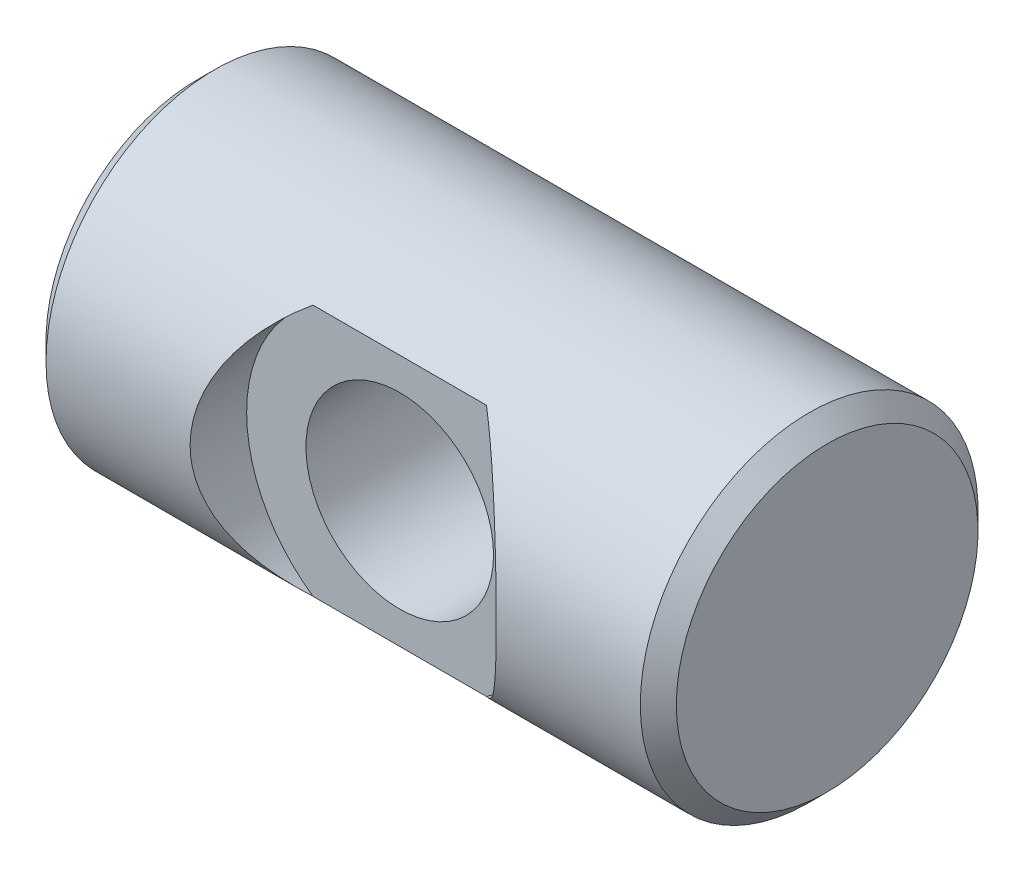
ISO-10303-21;
HEADER;
FILE_DESCRIPTION(('STEP AP214'),'2;1');
FILE_NAME('part.step','',(''),(''),'','','');
FILE_SCHEMA(('AUTOMOTIVE_DESIGN { 1 0 10303 214 1 1 1 1 }'));
ENDSEC;
DATA;
#1=APPLICATION_CONTEXT('core data for automotive mechanical design processes');
#2=APPLICATION_PROTOCOL_DEFINITION('international standard','automotive_design',2000,#1);
#3=PRODUCT_CONTEXT('',#1,'mechanical');
#4=PRODUCT('Part','Part','',(#3));
#5=PRODUCT_RELATED_PRODUCT_CATEGORY('part','',(#4));
#6=PRODUCT_DEFINITION_FORMATION('','',#4);
#7=PRODUCT_DEFINITION_CONTEXT('part definition',#1,'design');
#8=PRODUCT_DEFINITION('design','',#6,#7);
#9=PRODUCT_DEFINITION_SHAPE('','',#8);
#10=(LENGTH_UNIT() NAMED_UNIT(*) SI_UNIT(.MILLI.,.METRE.));
#11=(NAMED_UNIT(*) PLANE_ANGLE_UNIT() SI_UNIT($,.RADIAN.));
#12=(NAMED_UNIT(*) SI_UNIT($,.STERADIAN.) SOLID_ANGLE_UNIT());
#13=UNCERTAINTY_MEASURE_WITH_UNIT(LENGTH_MEASURE(1.E-05),#10,'distance_accuracy_value','');
#14=(GEOMETRIC_REPRESENTATION_CONTEXT(3) GLOBAL_UNCERTAINTY_ASSIGNED_CONTEXT((#13)) GLOBAL_UNIT_ASSIGNED_CONTEXT((#10,
#11,#12)) REPRESENTATION_CONTEXT('',''));
#15=CARTESIAN_POINT('',(0.,0.,0.));
#16=DIRECTION('',(0.,0.,1.));
#17=DIRECTION('',(1.,0.,0.));
#18=AXIS2_PLACEMENT_3D('',#15,#16,#17);
#19=CARTESIAN_POINT('',(13.335,-6.458331,6.458331));
#20=DIRECTION('',(1.,0.,0.));
#21=DIRECTION('',(0.,0.,-1.));
#22=AXIS2_PLACEMENT_3D('',#19,#20,#21);
#23=PLANE('',#22);
#24=CARTESIAN_POINT('',(13.335,0.,0.));
#25=DIRECTION('',(-1.,0.,0.));
#26=DIRECTION('',(0.,0.,1.));
#27=AXIS2_PLACEMENT_3D('',#24,#25,#26);
#28=CIRCLE('',#27,6.38175);
#29=CARTESIAN_POINT('',(13.335,0.,6.38175));
#30=VERTEX_POINT('',#29);
#31=EDGE_CURVE('E21',#30,#30,#28,.T.);
#32=ORIENTED_EDGE('',*,*,#31,.F.);
#33=EDGE_LOOP('',(#32));
#34=FACE_BOUND('',#33,.T.);
#35=ADVANCED_FACE('F16',(#34),#23,.T.);
#36=CARTESIAN_POINT('',(-13.335,-6.458331,-6.458331));
#37=DIRECTION('',(-1.,0.,0.));
#38=DIRECTION('',(0.,0.,1.));
#39=AXIS2_PLACEMENT_3D('',#36,#37,#38);
#40=PLANE('',#39);
#41=CARTESIAN_POINT('',(-13.335,0.,0.));
#42=DIRECTION('',(1.,0.,0.));
#43=DIRECTION('',(0.,0.,-1.));
#44=AXIS2_PLACEMENT_3D('',#41,#42,#43);
#45=CIRCLE('',#44,6.38175);
#46=CARTESIAN_POINT('',(-13.335,0.,-6.38175));
#47=VERTEX_POINT('',#46);
#48=EDGE_CURVE('E57',#47,#47,#45,.T.);
#49=ORIENTED_EDGE('',*,*,#48,.F.);
#50=EDGE_LOOP('',(#49));
#51=FACE_BOUND('',#50,.T.);
#52=ADVANCED_FACE('F112',(#51),#40,.T.);
#53=CARTESIAN_POINT('',(0.,0.,-5.385435));
#54=DIRECTION('',(0.,0.,1.));
#55=DIRECTION('',(1.,0.,0.));
#56=AXIS2_PLACEMENT_3D('',#53,#54,#55);
#57=CYLINDRICAL_SURFACE('',#56,3.96875);
#58=CARTESIAN_POINT('',(0.,0.,4.7498));
#59=DIRECTION('',(0.,0.,1.));
#60=DIRECTION('',(1.,0.,0.));
#61=AXIS2_PLACEMENT_3D('',#58,#59,#60);
#62=CIRCLE('',#61,3.96875);
#63=CARTESIAN_POINT('',(3.96875,0.,4.7498));
#64=VERTEX_POINT('',#63);
#65=EDGE_CURVE('E60',#64,#64,#62,.F.);
#66=ORIENTED_EDGE('',*,*,#65,.F.);
#67=EDGE_LOOP('',(#66));
#68=FACE_BOUND('',#67,.T.);
#69=CARTESIAN_POINT('',(0.,0.,-4.46405));
#70=DIRECTION('',(0.,0.,1.));
#71=DIRECTION('',(1.,0.,0.));
#72=AXIS2_PLACEMENT_3D('',#69,#70,#71);
#73=CIRCLE('',#72,3.96875);
#74=CARTESIAN_POINT('',(3.96875,0.,-4.46405));
#75=VERTEX_POINT('',#74);
#76=EDGE_CURVE('E67',#75,#75,#73,.T.);
#77=ORIENTED_EDGE('',*,*,#76,.F.);
#78=EDGE_LOOP('',(#77));
#79=FACE_BOUND('',#78,.T.);
#80=ADVANCED_FACE('F108',(#68,#79),#57,.F.);
#81=CARTESIAN_POINT('',(12.4968,0.,0.));
#82=DIRECTION('',(-1.,0.,0.));
#83=DIRECTION('',(0.,0.,1.));
#84=AXIS2_PLACEMENT_3D('',#81,#82,#83);
#85=CONICAL_SURFACE('',#84,7.21995,0.785398163397449);
#86=CARTESIAN_POINT('',(12.573,0.,0.));
#87=DIRECTION('',(-1.,0.,0.));
#88=DIRECTION('',(0.,0.,1.));
#89=AXIS2_PLACEMENT_3D('',#86,#87,#88);
#90=CIRCLE('',#89,7.14375);
#91=CARTESIAN_POINT('',(12.573,0.,7.14375));
#92=VERTEX_POINT('',#91);
#93=EDGE_CURVE('E63',#92,#92,#90,.T.);
#94=ORIENTED_EDGE('',*,*,#93,.F.);
#95=EDGE_LOOP('',(#94));
#96=FACE_BOUND('',#95,.T.);
#97=ORIENTED_EDGE('',*,*,#31,.T.);
#98=EDGE_LOOP('',(#97));
#99=FACE_BOUND('',#98,.T.);
#100=ADVANCED_FACE('F105',(#96,#99),#85,.T.);
#101=CARTESIAN_POINT('',(0.,0.,-4.46405));
#102=DIRECTION('',(0.,0.,-1.));
#103=DIRECTION('',(-1.,0.,0.));
#104=AXIS2_PLACEMENT_3D('',#101,#102,#103);
#105=CONICAL_SURFACE('',#104,3.96875,0.785398163397448);
#106=ORIENTED_EDGE('',*,*,#76,.T.);
#107=EDGE_LOOP('',(#106));
#108=FACE_BOUND('',#107,.T.);
#109=CARTESIAN_POINT('',(6.64845,0.,-7.14375));
#110=CARTESIAN_POINT('',(6.64844922554863,0.0975328309638017,-7.14374954691133));
#111=CARTESIAN_POINT('',(6.64429583469929,0.195097621934713,-7.14174647909495));
#112=CARTESIAN_POINT('',(6.62777798764608,0.389412377086942,-7.13379219114021));
#113=CARTESIAN_POINT('',(6.61540784680679,0.48616173015913,-7.12783823764362));
#114=CARTESIAN_POINT('',(6.58270480313593,0.678211144412676,-7.1121369056468));
#115=CARTESIAN_POINT('',(6.56235464543808,0.773507597028725,-7.10238130729147));
#116=CARTESIAN_POINT('',(6.51414245980087,0.961762207501411,-7.079349721587));
#117=CARTESIAN_POINT('',(6.48627678359498,1.05471920569051,-7.06607202455324));
#118=CARTESIAN_POINT('',(6.39276486077822,1.32755171329717,-7.02171094452753));
#119=CARTESIAN_POINT('',(6.31687074933412,1.50324720001825,-6.98593716211935));
#120=CARTESIAN_POINT('',(6.1424859404007,1.84025165023085,-6.9048393357192));
#121=CARTESIAN_POINT('',(6.04399573760137,2.00156092856831,-6.85951550080566));
#122=CARTESIAN_POINT('',(5.7700524077852,2.39303765220652,-6.73562653112987));
#123=CARTESIAN_POINT('',(5.58190118357553,2.61284581190901,-6.65240328780338));
#124=CARTESIAN_POINT('',(5.17397148316249,3.01785847862766,-6.47877436914566));
#125=CARTESIAN_POINT('',(4.95410103061122,3.20295862332616,-6.38834816118937));
#126=CARTESIAN_POINT('',(4.56202141388186,3.48874787334528,-6.23532966663945));
#127=CARTESIAN_POINT('',(4.39587503406056,3.59791495023201,-6.17270614434584));
#128=CARTESIAN_POINT('',(4.05392234692623,3.80141663388263,-6.04950921846992));
#129=CARTESIAN_POINT('',(3.87811254493764,3.89574582641955,-5.98893656953269));
#130=CARTESIAN_POINT('',(3.51814366992838,4.07014500037473,-5.87180706575101));
#131=CARTESIAN_POINT('',(3.33397914243507,4.15020549323046,-5.81525289807929));
#132=CARTESIAN_POINT('',(2.95851547067928,4.29634165868576,-5.70813625029094));
#133=CARTESIAN_POINT('',(2.76721689509621,4.36241844318381,-5.65757329393085));
#134=CARTESIAN_POINT('',(2.36792958267314,4.48395135862596,-5.56180347479819));
#135=CARTESIAN_POINT('',(2.15959877165055,4.5386352670204,-5.51703695549247));
#136=CARTESIAN_POINT('',(1.73744348931549,4.63257222090526,-5.43840048279373));
#137=CARTESIAN_POINT('',(1.52361885054962,4.67182479544843,-5.40453086196773));
#138=CARTESIAN_POINT('',(1.09249863872925,4.73465820991375,-5.3495722475294));
#139=CARTESIAN_POINT('',(0.875211214026768,4.7582714904437,-5.32845680596964));
#140=CARTESIAN_POINT('',(0.43860998441364,4.78977560848834,-5.30015800699407));
#141=CARTESIAN_POINT('',(0.219296516493492,4.79766901500789,-5.29297237311833));
#142=CARTESIAN_POINT('',(-0.193656616360596,4.79767042313307,-5.2929674576491));
#143=CARTESIAN_POINT('',(-0.387300013451353,4.79151613335269,-5.29856670619965));
#144=CARTESIAN_POINT('',(-0.773168185818496,4.76694612476646,-5.32068258541751));
#145=CARTESIAN_POINT('',(-0.965393035963558,4.74853105781286,-5.33719863568555));
#146=CARTESIAN_POINT('',(-1.34734940560458,4.69952324298965,-5.38040026353911));
#147=CARTESIAN_POINT('',(-1.53707766366745,4.66891593868052,-5.40709799551119));
#148=CARTESIAN_POINT('',(-1.91267931596779,4.59565093751173,-5.46950335087296));
#149=CARTESIAN_POINT('',(-2.09855253004215,4.55299267881421,-5.50521139433179));
#150=CARTESIAN_POINT('',(-2.46916383352781,4.45472400239111,-5.58504098862881));
#151=CARTESIAN_POINT('',(-2.65380389711317,4.39887033030433,-5.62931731790636));
#152=CARTESIAN_POINT('',(-3.01716077627589,4.27466735228567,-5.72420197429708));
#153=CARTESIAN_POINT('',(-3.1958772553868,4.20631733797903,-5.77481066031846));
#154=CARTESIAN_POINT('',(-3.54651118360341,4.05692026388358,-5.88072710444313));
#155=CARTESIAN_POINT('',(-3.71842816471034,3.97587233201519,-5.9360351851764));
#156=CARTESIAN_POINT('',(-4.05437431652258,3.80074075720832,-6.0496623381038));
#157=CARTESIAN_POINT('',(-4.21840522448533,3.70666000321661,-6.10798074121632));
#158=CARTESIAN_POINT('',(-4.63076002459908,3.44588011612477,-6.26047003426759));
#159=CARTESIAN_POINT('',(-4.87233060013015,3.26887140492092,-6.35567790035214));
#160=CARTESIAN_POINT('',(-5.32532559614502,2.87803937364742,-6.54192437662612));
#161=CARTESIAN_POINT('',(-5.53680893830637,2.66428987096661,-6.6329708919868));
#162=CARTESIAN_POINT('',(-5.8633801650169,2.2648486862315,-6.77752362233892));
#163=CARTESIAN_POINT('',(-5.98870164805505,2.08875689226366,-6.83429730078354));
#164=CARTESIAN_POINT('',(-6.21221019992348,1.71702811901188,-6.93700100490925));
#165=CARTESIAN_POINT('',(-6.31042360149531,1.52141036059031,-6.98294154751345));
#166=CARTESIAN_POINT('',(-6.45869630128873,1.14864000356536,-7.05289627607204));
#167=CARTESIAN_POINT('',(-6.51412933717157,0.974087628001204,-7.07932131682982));
#168=CARTESIAN_POINT('',(-6.59763696747328,0.617339497031646,-7.11927076685345));
#169=CARTESIAN_POINT('',(-6.6257892675211,0.435167001949558,-7.13283181518766));
#170=CARTESIAN_POINT('',(-6.64230005549649,0.210046850036334,-7.14078627468056));
#171=CARTESIAN_POINT('',(-6.64460371223891,0.168085922477724,-7.1418962190977));
#172=CARTESIAN_POINT('',(-6.64767894402863,0.0840853157028404,-7.14337822402094));
#173=CARTESIAN_POINT('',(-6.64845033385982,0.0420456275808975,-7.14375019532292));
#174=CARTESIAN_POINT('',(-6.64844922554863,-0.0975328309638022,-7.14374954691133));
#175=CARTESIAN_POINT('',(-6.64429583469929,-0.195097621934714,-7.14174647909495));
#176=CARTESIAN_POINT('',(-6.62777798764608,-0.389412377086942,-7.13379219114021));
#177=CARTESIAN_POINT('',(-6.61540784680679,-0.486161730159131,-7.12783823764362));
#178=CARTESIAN_POINT('',(-6.58270480313593,-0.678211144412675,-7.1121369056468));
#179=CARTESIAN_POINT('',(-6.56235464543808,-0.773507597028724,-7.10238130729147));
#180=CARTESIAN_POINT('',(-6.51414245980087,-0.96176220750141,-7.079349721587));
#181=CARTESIAN_POINT('',(-6.48627678359498,-1.05471920569051,-7.06607202455324));
#182=CARTESIAN_POINT('',(-6.39276486077822,-1.32755171329717,-7.02171094452753));
#183=CARTESIAN_POINT('',(-6.31687074933412,-1.50324720001825,-6.98593716211935));
#184=CARTESIAN_POINT('',(-6.1424859404007,-1.84025165023085,-6.9048393357192));
#185=CARTESIAN_POINT('',(-6.04399573760137,-2.00156092856831,-6.85951550080566));
#186=CARTESIAN_POINT('',(-5.7700524077852,-2.39303765220652,-6.73562653112987));
#187=CARTESIAN_POINT('',(-5.58190118357552,-2.61284581190901,-6.65240328780338));
#188=CARTESIAN_POINT('',(-5.17397148316249,-3.01785847862766,-6.47877436914566));
#189=CARTESIAN_POINT('',(-4.95410103061122,-3.20295862332616,-6.38834816118937));
#190=CARTESIAN_POINT('',(-4.56202141388186,-3.48874787334528,-6.23532966663945));
#191=CARTESIAN_POINT('',(-4.39587503406056,-3.59791495023201,-6.17270614434584));
#192=CARTESIAN_POINT('',(-4.05392234692624,-3.80141663388263,-6.04950921846992));
#193=CARTESIAN_POINT('',(-3.87811254493764,-3.89574582641955,-5.98893656953269));
#194=CARTESIAN_POINT('',(-3.51814366992838,-4.07014500037473,-5.87180706575101));
#195=CARTESIAN_POINT('',(-3.33397914243507,-4.15020549323046,-5.81525289807929));
#196=CARTESIAN_POINT('',(-2.95851547067928,-4.29634165868576,-5.70813625029094));
#197=CARTESIAN_POINT('',(-2.76721689509621,-4.36241844318381,-5.65757329393085));
#198=CARTESIAN_POINT('',(-2.36792958267314,-4.48395135862596,-5.56180347479819));
#199=CARTESIAN_POINT('',(-2.15959877165055,-4.5386352670204,-5.51703695549247));
#200=CARTESIAN_POINT('',(-1.73744348931549,-4.63257222090526,-5.43840048279373));
#201=CARTESIAN_POINT('',(-1.52361885054962,-4.67182479544843,-5.40453086196773));
#202=CARTESIAN_POINT('',(-1.09249863872925,-4.73465820991375,-5.3495722475294));
#203=CARTESIAN_POINT('',(-0.875211214026767,-4.7582714904437,-5.32845680596964));
#204=CARTESIAN_POINT('',(-0.43860998441364,-4.78977560848834,-5.30015800699407));
#205=CARTESIAN_POINT('',(-0.219296516493492,-4.79766901500789,-5.29297237311833));
#206=CARTESIAN_POINT('',(0.193656616360596,-4.79767042313307,-5.2929674576491));
#207=CARTESIAN_POINT('',(0.387300013451353,-4.79151613335269,-5.29856670619965));
#208=CARTESIAN_POINT('',(0.773168185818496,-4.76694612476646,-5.32068258541751));
#209=CARTESIAN_POINT('',(0.965393035963558,-4.74853105781286,-5.33719863568555));
#210=CARTESIAN_POINT('',(1.34734940560458,-4.69952324298965,-5.38040026353911));
#211=CARTESIAN_POINT('',(1.53707766366745,-4.66891593868052,-5.40709799551119));
#212=CARTESIAN_POINT('',(1.91267931596779,-4.59565093751173,-5.46950335087296));
#213=CARTESIAN_POINT('',(2.09855253004215,-4.55299267881421,-5.50521139433179));
#214=CARTESIAN_POINT('',(2.46916383352781,-4.45472400239111,-5.58504098862881));
#215=CARTESIAN_POINT('',(2.65380389711317,-4.39887033030433,-5.62931731790636));
#216=CARTESIAN_POINT('',(3.01716077627589,-4.27466735228567,-5.72420197429708));
#217=CARTESIAN_POINT('',(3.1958772553868,-4.20631733797903,-5.77481066031846));
#218=CARTESIAN_POINT('',(3.54651118360341,-4.05692026388358,-5.88072710444313));
#219=CARTESIAN_POINT('',(3.71842816471034,-3.97587233201519,-5.9360351851764));
#220=CARTESIAN_POINT('',(4.05437431652258,-3.80074075720832,-6.0496623381038));
#221=CARTESIAN_POINT('',(4.21840522448533,-3.70666000321661,-6.10798074121631));
#222=CARTESIAN_POINT('',(4.63076002459908,-3.44588011612477,-6.26047003426759));
#223=CARTESIAN_POINT('',(4.87233060013015,-3.26887140492092,-6.35567790035214));
#224=CARTESIAN_POINT('',(5.32532559614502,-2.87803937364742,-6.54192437662612));
#225=CARTESIAN_POINT('',(5.53680893830637,-2.66428987096661,-6.6329708919868));
#226=CARTESIAN_POINT('',(5.8633801650169,-2.2648486862315,-6.77752362233892));
#227=CARTESIAN_POINT('',(5.98870164805505,-2.08875689226367,-6.83429730078354));
#228=CARTESIAN_POINT('',(6.21221019992348,-1.71702811901188,-6.93700100490925));
#229=CARTESIAN_POINT('',(6.31042360149531,-1.52141036059031,-6.98294154751346));
#230=CARTESIAN_POINT('',(6.45869630128873,-1.14864000356536,-7.05289627607204));
#231=CARTESIAN_POINT('',(6.51412933717157,-0.974087628001205,-7.07932131682982));
#232=CARTESIAN_POINT('',(6.59763696747328,-0.617339497031648,-7.11927076685345));
#233=CARTESIAN_POINT('',(6.6257892675211,-0.435167001949559,-7.13283181518766));
#234=CARTESIAN_POINT('',(6.64230005549649,-0.210046850036333,-7.14078627468056));
#235=CARTESIAN_POINT('',(6.64460371223891,-0.168085922477721,-7.1418962190977));
#236=CARTESIAN_POINT('',(6.64767894402863,-0.0840853157028382,-7.14337822402094));
#237=CARTESIAN_POINT('',(6.64845033385982,-0.0420456275808965,-7.14375019532292));
#238=CARTESIAN_POINT('',(6.64845,0.,-7.14375));
#239=B_SPLINE_CURVE_WITH_KNOTS('',3,(#109,#110,#111,#112,#113,#114,#115,#116,#117,#118,#119,
#120,#121,#122,#123,#124,#125,#126,#127,#128,#129,#130,#131,#132,#133,#134,#135,#136,#137,#138,
#139,#140,#141,#142,#143,#144,#145,#146,#147,#148,#149,#150,#151,#152,#153,#154,#155,#156,#157,
#158,#159,#160,#161,#162,#163,#164,#165,#166,#167,#168,#169,#170,#171,#172,#173,#174,#175,#176,
#177,#178,#179,#180,#181,#182,#183,#184,#185,#186,#187,#188,#189,#190,#191,#192,#193,#194,#195,
#196,#197,#198,#199,#200,#201,#202,#203,#204,#205,#206,#207,#208,#209,#210,#211,#212,#213,#214,
#215,#216,#217,#218,#219,#220,#221,#222,#223,#224,#225,#226,#227,#228,#229,#230,#231,#232,#233,
#234,#235,#236,#237,#238),.UNSPECIFIED.,.T.,.F.,(4,2,2,2,2,2,2,2,2,2,2,2,2,2,2,2,2,2,2,2,2,2,2,
2,2,2,2,2,2,2,2,2,2,2,2,2,2,2,2,2,2,2,2,2,2,2,2,2,2,2,2,2,2,2,2,2,2,2,2,2,2,2,2,2,4),(0.,
0.292545882578971,0.585294369740784,0.87867937674401,1.17220705909232,1.75365124081287,
2.33508269435099,3.23325344893674,4.13408302996607,4.75864458736881,5.38343351632459,
6.0086363867751,6.63378952624567,7.29291286763137,7.9520563231714,8.60982819835236,
9.26749256899152,9.84826356688688,10.4290036901766,11.0104392533029,11.5919019285093,
12.1850597824455,12.7782512708954,13.3714835169836,13.9645844728471,14.9042591166037,
15.8420674308032,16.5102679257879,17.1778170291244,17.7306971865453,18.2819978669492,
18.4080968282455,18.534211031101,18.82675691368,19.1195054008418,19.412890407845,
19.7064180901933,20.2878622719139,20.869293725452,21.7674644800377,22.6682940610671,
23.2928556184698,23.9176445474256,24.5428474178761,25.1680005573467,25.8271238987324,
26.4862673542724,27.1440392294533,27.8017036000925,28.3824745979879,28.9632147212776,
29.5446502844039,30.1261129596103,30.7192708135465,31.3124623019964,31.9056945480846,
32.4987955039481,33.4384701477047,34.3762784619042,35.0444789568889,35.7120280602254,
36.2649082176463,36.8162088980502,36.9423078593465,37.068422062202),.UNSPECIFIED.);
#240=CARTESIAN_POINT('',(6.64845,0.,-7.14375));
#241=VERTEX_POINT('',#240);
#242=EDGE_CURVE('E91',#241,#241,#239,.T.);
#243=ORIENTED_EDGE('',*,*,#242,.F.);
#244=EDGE_LOOP('',(#243));
#245=FACE_BOUND('',#244,.T.);
#246=ADVANCED_FACE('F100',(#108,#245),#105,.F.);
#247=CARTESIAN_POINT('',(-12.4968,0.,0.));
#248=DIRECTION('',(1.,0.,0.));
#249=DIRECTION('',(0.,0.,-1.));
#250=AXIS2_PLACEMENT_3D('',#247,#248,#249);
#251=CONICAL_SURFACE('',#250,7.21995,0.785398163397449);
#252=CARTESIAN_POINT('',(-12.573,0.,0.));
#253=DIRECTION('',(1.,0.,0.));
#254=DIRECTION('',(0.,0.,-1.));
#255=AXIS2_PLACEMENT_3D('',#252,#253,#254);
#256=CIRCLE('',#255,7.14375);
#257=CARTESIAN_POINT('',(-12.573,0.,-7.14375));
#258=VERTEX_POINT('',#257);
#259=EDGE_CURVE('E52',#258,#258,#256,.T.);
#260=ORIENTED_EDGE('',*,*,#259,.F.);
#261=EDGE_LOOP('',(#260));
#262=FACE_BOUND('',#261,.T.);
#263=ORIENTED_EDGE('',*,*,#48,.T.);
#264=EDGE_LOOP('',(#263));
#265=FACE_BOUND('',#264,.T.);
#266=ADVANCED_FACE('F98',(#262,#265),#251,.T.);
#267=CARTESIAN_POINT('',(0.,0.,4.50896863));
#268=DIRECTION('',(0.,0.,1.));
#269=DIRECTION('',(1.,0.,0.));
#270=AXIS2_PLACEMENT_3D('',#267,#268,#269);
#271=CYLINDRICAL_SURFACE('',#270,6.47699999999987);
#272=CARTESIAN_POINT('',(-3.67137099426075,-5.33596889257232,4.74980000000005));
#273=CARTESIAN_POINT('',(-3.74777031123753,-5.28339864199494,4.80885945253468));
#274=CARTESIAN_POINT('',(-3.8230915266985,-5.2291613016055,4.86781422390483));
#275=CARTESIAN_POINT('',(-3.97156370624629,-5.11730987468293,4.98526602796292));
#276=CARTESIAN_POINT('',(-4.04471450778456,-5.05969553619335,5.04376302612658));
#277=CARTESIAN_POINT('',(-4.2610781488412,-4.88156669356811,5.21834676544785));
#278=CARTESIAN_POINT('',(-4.40098491585754,-4.75591557634639,5.33335691679628));
#279=CARTESIAN_POINT('',(-4.67256477629987,-4.48945162913801,5.55956941364718));
#280=CARTESIAN_POINT('',(-4.80414683045584,-4.34850587688,5.67072509924076));
#281=CARTESIAN_POINT('',(-5.05639333219858,-4.05243833552415,5.88595230160891));
#282=CARTESIAN_POINT('',(-5.17706529161305,-3.89732645031617,5.99002868021647));
#283=CARTESIAN_POINT('',(-5.4639821611825,-3.49077989740554,6.23934558829962));
#284=CARTESIAN_POINT('',(-5.62257955474957,-3.23017079420295,6.37892622521153));
#285=CARTESIAN_POINT('',(-5.83440276235501,-2.81695033222472,6.56664668025627));
#286=CARTESIAN_POINT('',(-5.90060308181735,-2.67566970141414,6.62555573608882));
#287=CARTESIAN_POINT('',(-6.02356007726719,-2.38599494279526,6.73529031859205));
#288=CARTESIAN_POINT('',(-6.08031866775872,-2.23760226498021,6.78611748393915));
#289=CARTESIAN_POINT('',(-6.17562067425546,-1.95747232201485,6.87164868625843));
#290=CARTESIAN_POINT('',(-6.21562094333131,-1.82661747113721,6.9076287733323));
#291=CARTESIAN_POINT('',(-6.28758625639761,-1.56099610260124,6.97245517921118));
#292=CARTESIAN_POINT('',(-6.31955282747325,-1.42623033379056,7.00130285376364));
#293=CARTESIAN_POINT('',(-6.37491751837126,-1.15379654325841,7.05131674582043));
#294=CARTESIAN_POINT('',(-6.39833036455787,-1.01613394522388,7.07249616466692));
#295=CARTESIAN_POINT('',(-6.43626509937011,-0.738652450766004,7.10683319088646));
#296=CARTESIAN_POINT('',(-6.45079187449735,-0.598834782875756,7.11999520705861));
#297=CARTESIAN_POINT('',(-6.4661605927391,-0.38227851555516,7.13392342298016));
#298=CARTESIAN_POINT('',(-6.47022272544475,-0.305933463502245,7.13760574807528));
#299=CARTESIAN_POINT('',(-6.47564296424174,-0.153062772666849,7.14251955618692));
#300=CARTESIAN_POINT('',(-6.47700083424827,-0.0765371187014686,7.14375082522379));
#301=CARTESIAN_POINT('',(-6.47699836964419,0.149575039770129,7.14374838728079));
#302=CARTESIAN_POINT('',(-6.47180755646698,0.299193865825053,7.13904114244996));
#303=CARTESIAN_POINT('',(-6.45114073891711,0.597200791382787,7.12031132868162));
#304=CARTESIAN_POINT('',(-6.43565808978551,0.745588033024991,7.10628274157132));
#305=CARTESIAN_POINT('',(-6.39467149398479,1.04012158602088,7.0691854156935));
#306=CARTESIAN_POINT('',(-6.36914813214932,1.18626298241573,7.0460991628556));
#307=CARTESIAN_POINT('',(-6.30854627637027,1.47497366554555,6.99136769431661));
#308=CARTESIAN_POINT('',(-6.27346322943234,1.61754121474196,6.95971840034404));
#309=CARTESIAN_POINT('',(-6.1946511568016,1.89703429431936,6.88876225968584));
#310=CARTESIAN_POINT('',(-6.15099161023068,2.03399512368595,6.84951698413974));
#311=CARTESIAN_POINT('',(-6.05550682072226,2.30276773372596,6.76390081587468));
#312=CARTESIAN_POINT('',(-6.00367798168867,2.43457721475342,6.71752678532418));
#313=CARTESIAN_POINT('',(-5.8369467461316,2.82139965510178,6.56879242852957));
#314=CARTESIAN_POINT('',(-5.7107451500774,3.067995194639,6.45677048625018));
#315=CARTESIAN_POINT('',(-5.47520097977229,3.4655527277176,6.24958740329038));
#316=CARTESIAN_POINT('',(-5.37213344657888,3.62303373658314,6.15942827311128));
#317=CARTESIAN_POINT('',(-5.155283160848,3.92545058621929,5.97123702915411));
#318=CARTESIAN_POINT('',(-5.04150009477882,4.07038605967487,5.87320468502167));
#319=CARTESIAN_POINT('',(-4.80437297123304,4.34774316419962,5.6709607968934));
#320=CARTESIAN_POINT('',(-4.68102139569729,4.48015477012684,5.56674440946597));
#321=CARTESIAN_POINT('',(-4.42578230254291,4.7324584537072,5.35389723185116));
#322=CARTESIAN_POINT('',(-4.29389853206437,4.85235596760358,5.24526838720775));
#323=CARTESIAN_POINT('',(-4.0794337226069,5.03192428235424,5.07161593718974));
#324=CARTESIAN_POINT('',(-3.99949597792248,5.09568358664162,5.00750702875657));
#325=CARTESIAN_POINT('',(-3.8372524280485,5.21894149983539,4.87890615638469));
#326=CARTESIAN_POINT('',(-3.75495490279806,5.27845293404039,4.81441604269465));
#327=CARTESIAN_POINT('',(-3.67137099426074,5.33596889257233,4.74980000000005));
#328=B_SPLINE_CURVE_WITH_KNOTS('',3,(#272,#273,#274,#275,#276,#277,#278,#279,#280,#281,#282,
#283,#284,#285,#286,#287,#288,#289,#290,#291,#292,#293,#294,#295,#296,#297,#298,#299,#300,#301,
#302,#303,#304,#305,#306,#307,#308,#309,#310,#311,#312,#313,#314,#315,#316,#317,#318,#319,#320,
#321,#322,#323,#324,#325,#326,#327),.UNSPECIFIED.,.F.,.F.,(4,2,2,2,2,2,2,2,2,2,2,2,2,2,2,2,2,2,
2,2,2,2,2,2,2,2,2,4),(0.,0.329807348844185,0.65963933588036,1.32024088721893,1.98712984319652,
2.65355607866682,3.65554264230727,4.15537398249657,4.65510384776961,5.07912881455543,
5.50307311950397,5.92628407016086,6.34926208497249,6.57880915516163,6.8083762641596,
7.25701491218913,7.70594349827067,8.15574445337147,8.60576001089475,9.05227004688399,
9.49897718691176,10.3917907652381,11.0171458324507,11.6425192029606,12.268389010916,
12.8939857933178,13.2559579686557,13.6167864830537),.UNSPECIFIED.);
#329=CARTESIAN_POINT('',(-3.67137099426062,-5.33596889257241,4.74980000000003));
#330=VERTEX_POINT('',#329);
#331=CARTESIAN_POINT('',(-3.6713709942607,5.33596889257235,4.7498));
#332=VERTEX_POINT('',#331);
#333=EDGE_CURVE('E45',#330,#332,#328,.T.);
#334=ORIENTED_EDGE('',*,*,#333,.F.);
#335=CARTESIAN_POINT('',(0.,0.,4.7498));
#336=DIRECTION('',(0.,0.,1.));
#337=DIRECTION('',(1.,0.,0.));
#338=AXIS2_PLACEMENT_3D('',#335,#336,#337);
#339=CIRCLE('',#338,6.47699999999987);
#340=EDGE_CURVE('E49',#332,#330,#339,.T.);
#341=ORIENTED_EDGE('',*,*,#340,.F.);
#342=EDGE_LOOP('',(#334,#341));
#343=FACE_BOUND('',#342,.T.);
#344=ADVANCED_FACE('F47',(#343),#271,.F.);
#345=CARTESIAN_POINT('',(-6.554724,-5.33596889257249,4.7498));
#346=DIRECTION('',(0.,0.,1.));
#347=DIRECTION('',(1.,0.,0.));
#348=AXIS2_PLACEMENT_3D('',#345,#346,#347);
#349=PLANE('',#348);
#350=ORIENTED_EDGE('',*,*,#65,.T.);
#351=EDGE_LOOP('',(#350));
#352=FACE_BOUND('',#351,.T.);
#353=DIRECTION('',(1.,0.,0.));
#354=VECTOR('',#353,1.);
#355=CARTESIAN_POINT('',(0.,5.33596889257234,4.74980000000001));
#356=LINE('',#355,#354);
#357=CARTESIAN_POINT('',(3.67137099426103,5.33596889257235,4.7498));
#358=VERTEX_POINT('',#357);
#359=EDGE_CURVE('E51',#332,#358,#356,.T.);
#360=ORIENTED_EDGE('',*,*,#359,.F.);
#361=ORIENTED_EDGE('',*,*,#340,.T.);
#362=DIRECTION('',(1.,0.,0.));
#363=VECTOR('',#362,1.);
#364=CARTESIAN_POINT('',(0.,-5.33596889257249,4.7498));
#365=LINE('',#364,#363);
#366=CARTESIAN_POINT('',(3.67137099426087,-5.33596889257247,4.74979999999996));
#367=VERTEX_POINT('',#366);
#368=EDGE_CURVE('E54',#330,#367,#365,.T.);
#369=ORIENTED_EDGE('',*,*,#368,.T.);
#370=CARTESIAN_POINT('',(-3.50344473687403E-13,0.,4.7498));
#371=DIRECTION('',(0.,0.,1.));
#372=DIRECTION('',(1.,0.,0.));
#373=AXIS2_PLACEMENT_3D('',#370,#371,#372);
#374=CIRCLE('',#373,6.47700000000028);
#375=EDGE_CURVE('E27',#358,#367,#374,.F.);
#376=ORIENTED_EDGE('',*,*,#375,.F.);
#377=EDGE_LOOP('',(#360,#361,#369,#376));
#378=FACE_BOUND('',#377,.T.);
#379=ADVANCED_FACE('F59',(#352,#378),#349,.T.);
#380=CARTESIAN_POINT('',(12.573,0.,0.));
#381=DIRECTION('',(-1.,0.,0.));
#382=DIRECTION('',(0.,0.,1.));
#383=AXIS2_PLACEMENT_3D('',#380,#381,#382);
#384=CYLINDRICAL_SURFACE('',#383,7.14375);
#385=ORIENTED_EDGE('',*,*,#242,.T.);
#386=EDGE_LOOP('',(#385));
#387=FACE_BOUND('',#386,.T.);
#388=ORIENTED_EDGE('',*,*,#259,.T.);
#389=EDGE_LOOP('',(#388));
#390=FACE_BOUND('',#389,.T.);
#391=ORIENTED_EDGE('',*,*,#368,.F.);
#392=ORIENTED_EDGE('',*,*,#333,.T.);
#393=ORIENTED_EDGE('',*,*,#359,.T.);
#394=CARTESIAN_POINT('',(3.67137099426091,-5.33596889257244,4.74979999999992));
#395=CARTESIAN_POINT('',(3.74777031123769,-5.28339864199505,4.80885945253456));
#396=CARTESIAN_POINT('',(3.82309152669865,-5.22916130160561,4.86781422390471));
#397=CARTESIAN_POINT('',(3.97156370624643,-5.11730987468303,4.98526602796282));
#398=CARTESIAN_POINT('',(4.04471450778471,-5.05969553619344,5.04376302612648));
#399=CARTESIAN_POINT('',(4.26107814884134,-4.88156669356819,5.21834676544777));
#400=CARTESIAN_POINT('',(4.40098491585767,-4.75591557634647,5.33335691679622));
#401=CARTESIAN_POINT('',(4.6725647763,-4.48945162913806,5.55956941364713));
#402=CARTESIAN_POINT('',(4.80414683045596,-4.34850587688004,5.67072509924073));
#403=CARTESIAN_POINT('',(5.05639333219869,-4.05243833552417,5.8859523016089));
#404=CARTESIAN_POINT('',(5.17706529161316,-3.89732645031618,5.99002868021646));
#405=CARTESIAN_POINT('',(5.4639821611826,-3.49077989740554,6.23934558829963));
#406=CARTESIAN_POINT('',(5.62257955474965,-3.23017079420293,6.37892622521153));
#407=CARTESIAN_POINT('',(5.83440276235508,-2.81695033222469,6.56664668025628));
#408=CARTESIAN_POINT('',(5.90060308181742,-2.67566970141411,6.62555573608884));
#409=CARTESIAN_POINT('',(6.02356007726725,-2.38599494279522,6.73529031859206));
#410=CARTESIAN_POINT('',(6.08031866775878,-2.23760226498016,6.78611748393917));
#411=CARTESIAN_POINT('',(6.17562067425551,-1.95747232201479,6.87164868625844));
#412=CARTESIAN_POINT('',(6.21562094333136,-1.82661747113714,6.90762877333232));
#413=CARTESIAN_POINT('',(6.28758625639765,-1.56099610260116,6.9724551792112));
#414=CARTESIAN_POINT('',(6.31955282747329,-1.42623033379048,7.00130285376366));
#415=CARTESIAN_POINT('',(6.3749175183713,-1.15379654325832,7.05131674582045));
#416=CARTESIAN_POINT('',(6.39833036455791,-1.01613394522379,7.07249616466693));
#417=CARTESIAN_POINT('',(6.43626509937014,-0.7386524507659,7.10683319088647));
#418=CARTESIAN_POINT('',(6.45079187449738,-0.598834782875648,7.11999520705862));
#419=CARTESIAN_POINT('',(6.46616059273912,-0.382278515555061,7.13392342298016));
#420=CARTESIAN_POINT('',(6.47022272544477,-0.305933463502161,7.13760574807528));
#421=CARTESIAN_POINT('',(6.47564296424175,-0.153062772666793,7.14251955618692));
#422=CARTESIAN_POINT('',(6.47700083424828,-0.0765371187014271,7.1437508252238));
#423=CARTESIAN_POINT('',(6.4769983696442,0.149575039770163,7.14374838728079));
#424=CARTESIAN_POINT('',(6.471807556467,0.299193865825094,7.13904114244996));
#425=CARTESIAN_POINT('',(6.45114073891712,0.597200791382841,7.12031132868161));
#426=CARTESIAN_POINT('',(6.43565808978552,0.745588033025052,7.10628274157131));
#427=CARTESIAN_POINT('',(6.3946714939848,1.04012158602096,7.06918541569349));
#428=CARTESIAN_POINT('',(6.36914813214933,1.18626298241581,7.04609916285558));
#429=CARTESIAN_POINT('',(6.30854627637028,1.47497366554564,6.99136769431659));
#430=CARTESIAN_POINT('',(6.27346322943234,1.61754121474206,6.95971840034401));
#431=CARTESIAN_POINT('',(6.1946511568016,1.89703429431947,6.8887622596858));
#432=CARTESIAN_POINT('',(6.15099161023067,2.03399512368607,6.84951698413971));
#433=CARTESIAN_POINT('',(6.05550682072225,2.30276773372608,6.76390081587464));
#434=CARTESIAN_POINT('',(6.00367798168867,2.43457721475355,6.71752678532414));
#435=CARTESIAN_POINT('',(5.83694674613159,2.82139965510193,6.5687924285295));
#436=CARTESIAN_POINT('',(5.71074515007738,3.06799519463916,6.45677048625011));
#437=CARTESIAN_POINT('',(5.47520097977227,3.46555272771777,6.24958740329028));
#438=CARTESIAN_POINT('',(5.37213344657886,3.62303373658332,6.15942827311118));
#439=CARTESIAN_POINT('',(5.15528316084797,3.92545058621948,5.97123702915398));
#440=CARTESIAN_POINT('',(5.04150009477879,4.07038605967507,5.87320468502153));
#441=CARTESIAN_POINT('',(4.804372971233,4.34774316419984,5.67096079689323));
#442=CARTESIAN_POINT('',(4.68102139569725,4.48015477012706,5.56674440946579));
#443=CARTESIAN_POINT('',(4.42578230254287,4.73245845370743,5.35389723185095));
#444=CARTESIAN_POINT('',(4.29389853206432,4.85235596760383,5.24526838720753));
#445=CARTESIAN_POINT('',(4.07943372260688,5.03192428235446,5.07161593718952));
#446=CARTESIAN_POINT('',(3.9994959779225,5.09568358664181,5.00750702875637));
#447=CARTESIAN_POINT('',(3.83725242804859,5.21894149983554,4.87890615638453));
#448=CARTESIAN_POINT('',(3.75495490279819,5.27845293404052,4.81441604269451));
#449=CARTESIAN_POINT('',(3.67137099426091,5.33596889257244,4.74979999999992));
#450=B_SPLINE_CURVE_WITH_KNOTS('',3,(#394,#395,#396,#397,#398,#399,#400,#401,#402,#403,#404,
#405,#406,#407,#408,#409,#410,#411,#412,#413,#414,#415,#416,#417,#418,#419,#420,#421,#422,#423,
#424,#425,#426,#427,#428,#429,#430,#431,#432,#433,#434,#435,#436,#437,#438,#439,#440,#441,#442,
#443,#444,#445,#446,#447,#448,#449),.UNSPECIFIED.,.F.,.F.,(4,2,2,2,2,2,2,2,2,2,2,2,2,2,2,2,2,2,
2,2,2,2,2,2,2,2,2,4),(0.,0.329807348844196,0.659639335880383,1.32024088721898,1.98712984319659,
2.65355607866691,3.65554264230738,4.15537398249669,4.65510384776974,5.07912881455557,
5.50307311950413,5.92628407016103,6.34926208497267,6.57880915516177,6.80837626415969,
7.25701491218925,7.70594349827081,8.15574445337163,8.60576001089493,9.05227004688418,
9.49897718691198,10.3917907652384,11.017145832451,11.6425192029609,12.2683890109163,
12.8939857933182,13.2559579686559,13.6167864830539),.UNSPECIFIED.);
#451=EDGE_CURVE('E11',#367,#358,#450,.T.);
#452=ORIENTED_EDGE('',*,*,#451,.F.);
#453=EDGE_LOOP('',(#391,#392,#393,#452));
#454=FACE_BOUND('',#453,.T.);
#455=ORIENTED_EDGE('',*,*,#93,.T.);
#456=EDGE_LOOP('',(#455));
#457=FACE_BOUND('',#456,.T.);
#458=ADVANCED_FACE('F55',(#387,#390,#454,#457),#384,.T.);
#459=CARTESIAN_POINT('',(-3.50344473687403E-13,0.,4.50896863));
#460=DIRECTION('',(0.,0.,1.));
#461=DIRECTION('',(1.,0.,0.));
#462=AXIS2_PLACEMENT_3D('',#459,#460,#461);
#463=CYLINDRICAL_SURFACE('',#462,6.47700000000028);
#464=ORIENTED_EDGE('',*,*,#375,.T.);
#465=ORIENTED_EDGE('',*,*,#451,.T.);
#466=EDGE_LOOP('',(#464,#465));
#467=FACE_BOUND('',#466,.T.);
#468=ADVANCED_FACE('F18',(#467),#463,.F.);
#469=CLOSED_SHELL('',(#35,#52,#80,#100,#246,#266,#344,#379,#458,#468));
#470=MANIFOLD_SOLID_BREP('B1',#469);
#471=ADVANCED_BREP_SHAPE_REPRESENTATION('',(#18,#470),#14);
#472=SHAPE_DEFINITION_REPRESENTATION(#9,#471);
ENDSEC;
END-ISO-10303-21;
